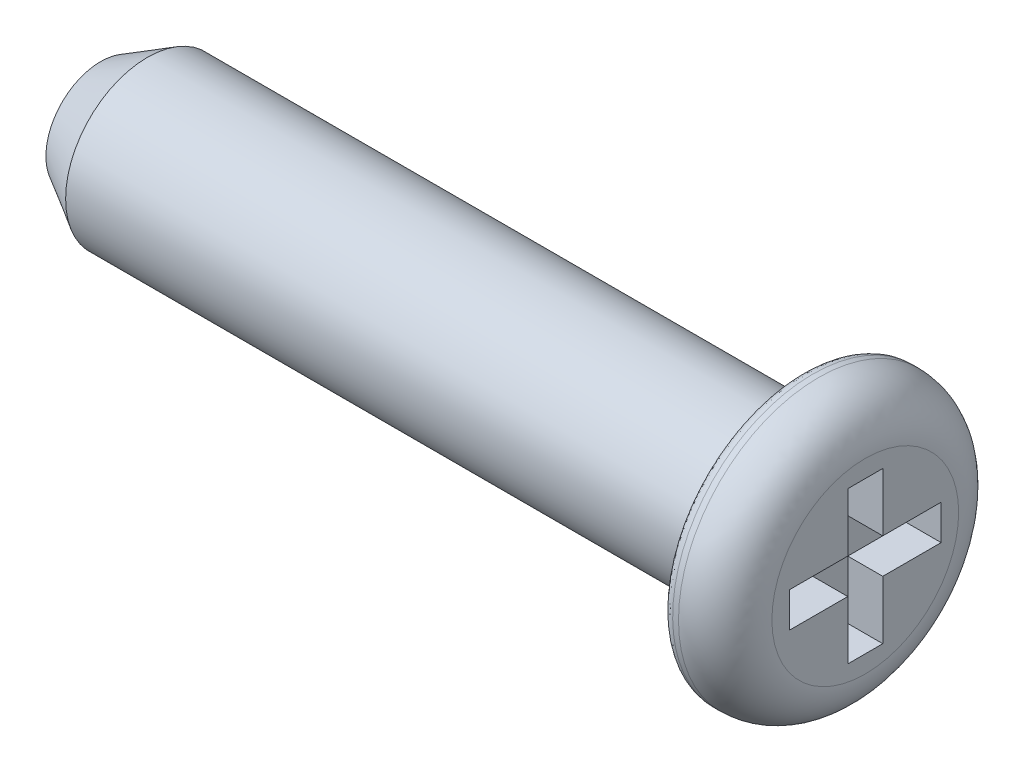
ISO-10303-21;
HEADER;
FILE_DESCRIPTION(('STEP AP214'),'2;1');
FILE_NAME('part.step','',(''),(''),'','','');
FILE_SCHEMA(('AUTOMOTIVE_DESIGN { 1 0 10303 214 1 1 1 1 }'));
ENDSEC;
DATA;
#1=APPLICATION_CONTEXT('core data for automotive mechanical design processes');
#2=APPLICATION_PROTOCOL_DEFINITION('international standard','automotive_design',2000,#1);
#3=PRODUCT_CONTEXT('',#1,'mechanical');
#4=PRODUCT('Part','Part','',(#3));
#5=PRODUCT_RELATED_PRODUCT_CATEGORY('part','',(#4));
#6=PRODUCT_DEFINITION_FORMATION('','',#4);
#7=PRODUCT_DEFINITION_CONTEXT('part definition',#1,'design');
#8=PRODUCT_DEFINITION('design','',#6,#7);
#9=PRODUCT_DEFINITION_SHAPE('','',#8);
#10=(LENGTH_UNIT() NAMED_UNIT(*) SI_UNIT(.MILLI.,.METRE.));
#11=(NAMED_UNIT(*) PLANE_ANGLE_UNIT() SI_UNIT($,.RADIAN.));
#12=(NAMED_UNIT(*) SI_UNIT($,.STERADIAN.) SOLID_ANGLE_UNIT());
#13=UNCERTAINTY_MEASURE_WITH_UNIT(LENGTH_MEASURE(1.E-05),#10,'distance_accuracy_value','');
#14=(GEOMETRIC_REPRESENTATION_CONTEXT(3) GLOBAL_UNCERTAINTY_ASSIGNED_CONTEXT((#13)) GLOBAL_UNIT_ASSIGNED_CONTEXT((#10,
#11,#12)) REPRESENTATION_CONTEXT('',''));
#15=CARTESIAN_POINT('',(0.,0.,0.));
#16=DIRECTION('',(0.,0.,1.));
#17=DIRECTION('',(1.,0.,0.));
#18=AXIS2_PLACEMENT_3D('',#15,#16,#17);
#19=CARTESIAN_POINT('',(6.75,29.024,9.876));
#20=DIRECTION('',(1.,0.,0.));
#21=DIRECTION('',(0.,0.,-1.));
#22=AXIS2_PLACEMENT_3D('',#19,#20,#21);
#23=PLANE('',#22);
#24=DIRECTION('',(0.,-1.,0.));
#25=VECTOR('',#24,1.);
#26=CARTESIAN_POINT('',(6.75,29.7,9.85));
#27=LINE('',#26,#25);
#28=CARTESIAN_POINT('',(6.75,29.85,9.85));
#29=VERTEX_POINT('',#28);
#30=CARTESIAN_POINT('',(6.75,29.55,9.85));
#31=VERTEX_POINT('',#30);
#32=EDGE_CURVE('E175',#29,#31,#27,.T.);
#33=ORIENTED_EDGE('',*,*,#32,.T.);
#34=DIRECTION('',(0.,0.,-1.));
#35=VECTOR('',#34,1.);
#36=CARTESIAN_POINT('',(6.75,29.55,9.6));
#37=LINE('',#36,#35);
#38=CARTESIAN_POINT('',(6.75,29.55,9.35));
#39=VERTEX_POINT('',#38);
#40=EDGE_CURVE('E368',#31,#39,#37,.T.);
#41=ORIENTED_EDGE('',*,*,#40,.T.);
#42=DIRECTION('',(0.,-1.,0.));
#43=VECTOR('',#42,1.);
#44=CARTESIAN_POINT('',(6.75,29.3,9.35));
#45=LINE('',#44,#43);
#46=CARTESIAN_POINT('',(6.75,29.05,9.35));
#47=VERTEX_POINT('',#46);
#48=EDGE_CURVE('E361',#39,#47,#45,.T.);
#49=ORIENTED_EDGE('',*,*,#48,.T.);
#50=DIRECTION('',(0.,0.,-1.));
#51=VECTOR('',#50,1.);
#52=CARTESIAN_POINT('',(6.75,29.05,9.2));
#53=LINE('',#52,#51);
#54=CARTESIAN_POINT('',(6.75,29.05,9.05));
#55=VERTEX_POINT('',#54);
#56=EDGE_CURVE('E354',#47,#55,#53,.T.);
#57=ORIENTED_EDGE('',*,*,#56,.T.);
#58=DIRECTION('',(0.,1.,0.));
#59=VECTOR('',#58,1.);
#60=CARTESIAN_POINT('',(6.75,29.3,9.05));
#61=LINE('',#60,#59);
#62=CARTESIAN_POINT('',(6.75,29.55,9.05));
#63=VERTEX_POINT('',#62);
#64=EDGE_CURVE('E347',#55,#63,#61,.T.);
#65=ORIENTED_EDGE('',*,*,#64,.T.);
#66=DIRECTION('',(0.,0.,-1.));
#67=VECTOR('',#66,1.);
#68=CARTESIAN_POINT('',(6.75,29.55,8.8));
#69=LINE('',#68,#67);
#70=CARTESIAN_POINT('',(6.75,29.55,8.55));
#71=VERTEX_POINT('',#70);
#72=EDGE_CURVE('E340',#63,#71,#69,.T.);
#73=ORIENTED_EDGE('',*,*,#72,.T.);
#74=DIRECTION('',(0.,1.,0.));
#75=VECTOR('',#74,1.);
#76=CARTESIAN_POINT('',(6.75,29.7,8.55));
#77=LINE('',#76,#75);
#78=CARTESIAN_POINT('',(6.75,29.85,8.55));
#79=VERTEX_POINT('',#78);
#80=EDGE_CURVE('E333',#71,#79,#77,.T.);
#81=ORIENTED_EDGE('',*,*,#80,.T.);
#82=DIRECTION('',(0.,0.,1.));
#83=VECTOR('',#82,1.);
#84=CARTESIAN_POINT('',(6.75,29.85,8.8));
#85=LINE('',#84,#83);
#86=CARTESIAN_POINT('',(6.75,29.85,9.05));
#87=VERTEX_POINT('',#86);
#88=EDGE_CURVE('E326',#79,#87,#85,.T.);
#89=ORIENTED_EDGE('',*,*,#88,.T.);
#90=DIRECTION('',(0.,1.,0.));
#91=VECTOR('',#90,1.);
#92=CARTESIAN_POINT('',(6.75,30.1,9.05));
#93=LINE('',#92,#91);
#94=CARTESIAN_POINT('',(6.75,30.35,9.05));
#95=VERTEX_POINT('',#94);
#96=EDGE_CURVE('E319',#87,#95,#93,.T.);
#97=ORIENTED_EDGE('',*,*,#96,.T.);
#98=DIRECTION('',(0.,0.,1.));
#99=VECTOR('',#98,1.);
#100=CARTESIAN_POINT('',(6.75,30.35,9.2));
#101=LINE('',#100,#99);
#102=CARTESIAN_POINT('',(6.75,30.35,9.35));
#103=VERTEX_POINT('',#102);
#104=EDGE_CURVE('E153',#95,#103,#101,.T.);
#105=ORIENTED_EDGE('',*,*,#104,.T.);
#106=DIRECTION('',(0.,-1.,0.));
#107=VECTOR('',#106,1.);
#108=CARTESIAN_POINT('',(6.75,30.1,9.35));
#109=LINE('',#108,#107);
#110=CARTESIAN_POINT('',(6.75,29.85,9.35));
#111=VERTEX_POINT('',#110);
#112=EDGE_CURVE('E150',#103,#111,#109,.T.);
#113=ORIENTED_EDGE('',*,*,#112,.T.);
#114=DIRECTION('',(0.,0.,1.));
#115=VECTOR('',#114,1.);
#116=CARTESIAN_POINT('',(6.75,29.85,9.6));
#117=LINE('',#116,#115);
#118=EDGE_CURVE('E146',#111,#29,#117,.T.);
#119=ORIENTED_EDGE('',*,*,#118,.T.);
#120=EDGE_LOOP('',(#33,#41,#49,#57,#65,#73,#81,#89,#97,#105,#113,#119));
#121=FACE_BOUND('',#120,.T.);
#122=ADVANCED_FACE('F16',(#121),#23,.T.);
#123=CARTESIAN_POINT('',(6.741146467985,30.36,9.35));
#124=DIRECTION('',(0.,0.,1.));
#125=DIRECTION('',(0.,-1.,0.));
#126=AXIS2_PLACEMENT_3D('',#123,#124,#125);
#127=PLANE('',#126);
#128=ORIENTED_EDGE('',*,*,#112,.F.);
#129=DIRECTION('',(1.,0.,0.));
#130=VECTOR('',#129,1.);
#131=CARTESIAN_POINT('',(6.9,30.35,9.35));
#132=LINE('',#131,#130);
#133=CARTESIAN_POINT('',(7.05,30.35,9.35));
#134=VERTEX_POINT('',#133);
#135=EDGE_CURVE('E305',#103,#134,#132,.T.);
#136=ORIENTED_EDGE('',*,*,#135,.T.);
#137=DIRECTION('',(0.,1.,0.));
#138=VECTOR('',#137,1.);
#139=CARTESIAN_POINT('',(7.05,29.7,9.35));
#140=LINE('',#139,#138);
#141=CARTESIAN_POINT('',(7.05,29.85,9.35));
#142=VERTEX_POINT('',#141);
#143=EDGE_CURVE('E162',#134,#142,#140,.F.);
#144=ORIENTED_EDGE('',*,*,#143,.T.);
#145=DIRECTION('',(-1.,0.,0.));
#146=VECTOR('',#145,1.);
#147=CARTESIAN_POINT('',(6.9,29.85,9.35));
#148=LINE('',#147,#146);
#149=EDGE_CURVE('E157',#142,#111,#148,.T.);
#150=ORIENTED_EDGE('',*,*,#149,.T.);
#151=EDGE_LOOP('',(#128,#136,#144,#150));
#152=FACE_BOUND('',#151,.T.);
#153=ADVANCED_FACE('F160',(#152),#127,.F.);
#154=CARTESIAN_POINT('',(6.741146467985,29.85,9.34));
#155=DIRECTION('',(0.,1.,0.));
#156=DIRECTION('',(0.,0.,1.));
#157=AXIS2_PLACEMENT_3D('',#154,#155,#156);
#158=PLANE('',#157);
#159=ORIENTED_EDGE('',*,*,#118,.F.);
#160=ORIENTED_EDGE('',*,*,#149,.F.);
#161=DIRECTION('',(0.,0.,-1.));
#162=VECTOR('',#161,1.);
#163=CARTESIAN_POINT('',(7.05,29.85,9.2));
#164=LINE('',#163,#162);
#165=CARTESIAN_POINT('',(7.05,29.85,9.85));
#166=VERTEX_POINT('',#165);
#167=EDGE_CURVE('E430',#142,#166,#164,.F.);
#168=ORIENTED_EDGE('',*,*,#167,.T.);
#169=DIRECTION('',(-1.,0.,0.));
#170=VECTOR('',#169,1.);
#171=CARTESIAN_POINT('',(6.9,29.85,9.85));
#172=LINE('',#171,#170);
#173=EDGE_CURVE('E169',#166,#29,#172,.T.);
#174=ORIENTED_EDGE('',*,*,#173,.T.);
#175=EDGE_LOOP('',(#159,#160,#168,#174));
#176=FACE_BOUND('',#175,.T.);
#177=ADVANCED_FACE('F167',(#176),#158,.F.);
#178=CARTESIAN_POINT('',(6.741146467985,29.85885353202,9.85));
#179=DIRECTION('',(0.,0.,1.));
#180=DIRECTION('',(0.,-1.,0.));
#181=AXIS2_PLACEMENT_3D('',#178,#179,#180);
#182=PLANE('',#181);
#183=ORIENTED_EDGE('',*,*,#32,.F.);
#184=ORIENTED_EDGE('',*,*,#173,.F.);
#185=DIRECTION('',(0.,1.,0.));
#186=VECTOR('',#185,1.);
#187=CARTESIAN_POINT('',(7.05,29.7,9.85));
#188=LINE('',#187,#186);
#189=CARTESIAN_POINT('',(7.05,29.55,9.85));
#190=VERTEX_POINT('',#189);
#191=EDGE_CURVE('E380',#166,#190,#188,.F.);
#192=ORIENTED_EDGE('',*,*,#191,.T.);
#193=DIRECTION('',(-1.,0.,0.));
#194=VECTOR('',#193,1.);
#195=CARTESIAN_POINT('',(6.9,29.55,9.85));
#196=LINE('',#195,#194);
#197=EDGE_CURVE('E371',#190,#31,#196,.T.);
#198=ORIENTED_EDGE('',*,*,#197,.T.);
#199=EDGE_LOOP('',(#183,#184,#192,#198));
#200=FACE_BOUND('',#199,.T.);
#201=ADVANCED_FACE('F378',(#200),#182,.F.);
#202=CARTESIAN_POINT('',(6.741146467985,29.55,9.86));
#203=DIRECTION('',(0.,-1.,0.));
#204=DIRECTION('',(0.,0.,-1.));
#205=AXIS2_PLACEMENT_3D('',#202,#203,#204);
#206=PLANE('',#205);
#207=ORIENTED_EDGE('',*,*,#40,.F.);
#208=ORIENTED_EDGE('',*,*,#197,.F.);
#209=DIRECTION('',(0.,0.,1.));
#210=VECTOR('',#209,1.);
#211=CARTESIAN_POINT('',(7.05,29.55,9.2));
#212=LINE('',#211,#210);
#213=CARTESIAN_POINT('',(7.05,29.55,9.35));
#214=VERTEX_POINT('',#213);
#215=EDGE_CURVE('E386',#190,#214,#212,.F.);
#216=ORIENTED_EDGE('',*,*,#215,.T.);
#217=DIRECTION('',(-1.,0.,0.));
#218=VECTOR('',#217,1.);
#219=CARTESIAN_POINT('',(6.9,29.55,9.35));
#220=LINE('',#219,#218);
#221=EDGE_CURVE('E364',#214,#39,#220,.T.);
#222=ORIENTED_EDGE('',*,*,#221,.T.);
#223=EDGE_LOOP('',(#207,#208,#216,#222));
#224=FACE_BOUND('',#223,.T.);
#225=ADVANCED_FACE('F383',(#224),#206,.F.);
#226=CARTESIAN_POINT('',(6.741146467985,29.56,9.35));
#227=DIRECTION('',(0.,0.,1.));
#228=DIRECTION('',(0.,-1.,0.));
#229=AXIS2_PLACEMENT_3D('',#226,#227,#228);
#230=PLANE('',#229);
#231=ORIENTED_EDGE('',*,*,#48,.F.);
#232=ORIENTED_EDGE('',*,*,#221,.F.);
#233=DIRECTION('',(0.,1.,0.));
#234=VECTOR('',#233,1.);
#235=CARTESIAN_POINT('',(7.05,29.7,9.35));
#236=LINE('',#235,#234);
#237=CARTESIAN_POINT('',(7.05,29.05,9.35));
#238=VERTEX_POINT('',#237);
#239=EDGE_CURVE('E440',#214,#238,#236,.F.);
#240=ORIENTED_EDGE('',*,*,#239,.T.);
#241=DIRECTION('',(-1.,0.,0.));
#242=VECTOR('',#241,1.);
#243=CARTESIAN_POINT('',(6.9,29.05,9.35));
#244=LINE('',#243,#242);
#245=EDGE_CURVE('E357',#238,#47,#244,.T.);
#246=ORIENTED_EDGE('',*,*,#245,.T.);
#247=EDGE_LOOP('',(#231,#232,#240,#246));
#248=FACE_BOUND('',#247,.T.);
#249=ADVANCED_FACE('F389',(#248),#230,.F.);
#250=CARTESIAN_POINT('',(6.741146467985,29.05,9.358853532015));
#251=DIRECTION('',(0.,-1.,0.));
#252=DIRECTION('',(0.,0.,-1.));
#253=AXIS2_PLACEMENT_3D('',#250,#251,#252);
#254=PLANE('',#253);
#255=ORIENTED_EDGE('',*,*,#56,.F.);
#256=ORIENTED_EDGE('',*,*,#245,.F.);
#257=DIRECTION('',(0.,0.,1.));
#258=VECTOR('',#257,1.);
#259=CARTESIAN_POINT('',(7.05,29.05,9.2));
#260=LINE('',#259,#258);
#261=CARTESIAN_POINT('',(7.05,29.05,9.05));
#262=VERTEX_POINT('',#261);
#263=EDGE_CURVE('E397',#238,#262,#260,.F.);
#264=ORIENTED_EDGE('',*,*,#263,.T.);
#265=DIRECTION('',(-1.,0.,0.));
#266=VECTOR('',#265,1.);
#267=CARTESIAN_POINT('',(6.9,29.05,9.05));
#268=LINE('',#267,#266);
#269=EDGE_CURVE('E350',#262,#55,#268,.T.);
#270=ORIENTED_EDGE('',*,*,#269,.T.);
#271=EDGE_LOOP('',(#255,#256,#264,#270));
#272=FACE_BOUND('',#271,.T.);
#273=ADVANCED_FACE('F395',(#272),#254,.F.);
#274=CARTESIAN_POINT('',(6.741146467985,29.04,9.05));
#275=DIRECTION('',(0.,0.,-1.));
#276=DIRECTION('',(0.,1.,0.));
#277=AXIS2_PLACEMENT_3D('',#274,#275,#276);
#278=PLANE('',#277);
#279=ORIENTED_EDGE('',*,*,#64,.F.);
#280=ORIENTED_EDGE('',*,*,#269,.F.);
#281=DIRECTION('',(0.,-1.,0.));
#282=VECTOR('',#281,1.);
#283=CARTESIAN_POINT('',(7.05,29.7,9.05));
#284=LINE('',#283,#282);
#285=CARTESIAN_POINT('',(7.05,29.55,9.05));
#286=VERTEX_POINT('',#285);
#287=EDGE_CURVE('E403',#262,#286,#284,.F.);
#288=ORIENTED_EDGE('',*,*,#287,.T.);
#289=DIRECTION('',(-1.,0.,0.));
#290=VECTOR('',#289,1.);
#291=CARTESIAN_POINT('',(6.9,29.55,9.05));
#292=LINE('',#291,#290);
#293=EDGE_CURVE('E343',#286,#63,#292,.T.);
#294=ORIENTED_EDGE('',*,*,#293,.T.);
#295=EDGE_LOOP('',(#279,#280,#288,#294));
#296=FACE_BOUND('',#295,.T.);
#297=ADVANCED_FACE('F400',(#296),#278,.F.);
#298=CARTESIAN_POINT('',(6.741146467985,29.55,9.06));
#299=DIRECTION('',(0.,-1.,0.));
#300=DIRECTION('',(0.,0.,-1.));
#301=AXIS2_PLACEMENT_3D('',#298,#299,#300);
#302=PLANE('',#301);
#303=ORIENTED_EDGE('',*,*,#72,.F.);
#304=ORIENTED_EDGE('',*,*,#293,.F.);
#305=DIRECTION('',(0.,0.,1.));
#306=VECTOR('',#305,1.);
#307=CARTESIAN_POINT('',(7.05,29.55,9.2));
#308=LINE('',#307,#306);
#309=CARTESIAN_POINT('',(7.05,29.55,8.55));
#310=VERTEX_POINT('',#309);
#311=EDGE_CURVE('E446',#286,#310,#308,.F.);
#312=ORIENTED_EDGE('',*,*,#311,.T.);
#313=DIRECTION('',(-1.,0.,0.));
#314=VECTOR('',#313,1.);
#315=CARTESIAN_POINT('',(6.9,29.55,8.55));
#316=LINE('',#315,#314);
#317=EDGE_CURVE('E336',#310,#71,#316,.T.);
#318=ORIENTED_EDGE('',*,*,#317,.T.);
#319=EDGE_LOOP('',(#303,#304,#312,#318));
#320=FACE_BOUND('',#319,.T.);
#321=ADVANCED_FACE('F406',(#320),#302,.F.);
#322=CARTESIAN_POINT('',(6.741146467985,29.54114646798,8.55));
#323=DIRECTION('',(0.,0.,-1.));
#324=DIRECTION('',(0.,1.,0.));
#325=AXIS2_PLACEMENT_3D('',#322,#323,#324);
#326=PLANE('',#325);
#327=ORIENTED_EDGE('',*,*,#80,.F.);
#328=ORIENTED_EDGE('',*,*,#317,.F.);
#329=DIRECTION('',(0.,-1.,0.));
#330=VECTOR('',#329,1.);
#331=CARTESIAN_POINT('',(7.05,29.7,8.55));
#332=LINE('',#331,#330);
#333=CARTESIAN_POINT('',(7.05,29.85,8.55));
#334=VERTEX_POINT('',#333);
#335=EDGE_CURVE('E414',#310,#334,#332,.F.);
#336=ORIENTED_EDGE('',*,*,#335,.T.);
#337=DIRECTION('',(-1.,0.,0.));
#338=VECTOR('',#337,1.);
#339=CARTESIAN_POINT('',(6.9,29.85,8.55));
#340=LINE('',#339,#338);
#341=EDGE_CURVE('E329',#334,#79,#340,.T.);
#342=ORIENTED_EDGE('',*,*,#341,.T.);
#343=EDGE_LOOP('',(#327,#328,#336,#342));
#344=FACE_BOUND('',#343,.T.);
#345=ADVANCED_FACE('F412',(#344),#326,.F.);
#346=CARTESIAN_POINT('',(6.741146467985,29.85,8.54));
#347=DIRECTION('',(0.,1.,0.));
#348=DIRECTION('',(0.,0.,1.));
#349=AXIS2_PLACEMENT_3D('',#346,#347,#348);
#350=PLANE('',#349);
#351=ORIENTED_EDGE('',*,*,#88,.F.);
#352=ORIENTED_EDGE('',*,*,#341,.F.);
#353=DIRECTION('',(0.,0.,-1.));
#354=VECTOR('',#353,1.);
#355=CARTESIAN_POINT('',(7.05,29.85,9.2));
#356=LINE('',#355,#354);
#357=CARTESIAN_POINT('',(7.05,29.85,9.05));
#358=VERTEX_POINT('',#357);
#359=EDGE_CURVE('E420',#334,#358,#356,.F.);
#360=ORIENTED_EDGE('',*,*,#359,.T.);
#361=DIRECTION('',(-1.,0.,0.));
#362=VECTOR('',#361,1.);
#363=CARTESIAN_POINT('',(6.9,29.85,9.05));
#364=LINE('',#363,#362);
#365=EDGE_CURVE('E322',#358,#87,#364,.T.);
#366=ORIENTED_EDGE('',*,*,#365,.T.);
#367=EDGE_LOOP('',(#351,#352,#360,#366));
#368=FACE_BOUND('',#367,.T.);
#369=ADVANCED_FACE('F417',(#368),#350,.F.);
#370=CARTESIAN_POINT('',(6.741146467985,29.84,9.05));
#371=DIRECTION('',(0.,0.,-1.));
#372=DIRECTION('',(0.,1.,0.));
#373=AXIS2_PLACEMENT_3D('',#370,#371,#372);
#374=PLANE('',#373);
#375=ORIENTED_EDGE('',*,*,#96,.F.);
#376=ORIENTED_EDGE('',*,*,#365,.F.);
#377=DIRECTION('',(0.,-1.,0.));
#378=VECTOR('',#377,1.);
#379=CARTESIAN_POINT('',(7.05,29.7,9.05));
#380=LINE('',#379,#378);
#381=CARTESIAN_POINT('',(7.05,30.35,9.05));
#382=VERTEX_POINT('',#381);
#383=EDGE_CURVE('E425',#358,#382,#380,.F.);
#384=ORIENTED_EDGE('',*,*,#383,.T.);
#385=DIRECTION('',(-1.,0.,0.));
#386=VECTOR('',#385,1.);
#387=CARTESIAN_POINT('',(6.9,30.35,9.05));
#388=LINE('',#387,#386);
#389=EDGE_CURVE('E315',#382,#95,#388,.T.);
#390=ORIENTED_EDGE('',*,*,#389,.T.);
#391=EDGE_LOOP('',(#375,#376,#384,#390));
#392=FACE_BOUND('',#391,.T.);
#393=ADVANCED_FACE('F423',(#392),#374,.F.);
#394=CARTESIAN_POINT('',(6.741146467985,30.35,9.041146467985));
#395=DIRECTION('',(0.,1.,0.));
#396=DIRECTION('',(0.,0.,1.));
#397=AXIS2_PLACEMENT_3D('',#394,#395,#396);
#398=PLANE('',#397);
#399=ORIENTED_EDGE('',*,*,#104,.F.);
#400=ORIENTED_EDGE('',*,*,#389,.F.);
#401=DIRECTION('',(0.,0.,-1.));
#402=VECTOR('',#401,1.);
#403=CARTESIAN_POINT('',(7.05,30.35,9.2));
#404=LINE('',#403,#402);
#405=EDGE_CURVE('E288',#382,#134,#404,.F.);
#406=ORIENTED_EDGE('',*,*,#405,.T.);
#407=ORIENTED_EDGE('',*,*,#135,.F.);
#408=EDGE_LOOP('',(#399,#400,#406,#407));
#409=FACE_BOUND('',#408,.T.);
#410=ADVANCED_FACE('F199',(#409),#398,.F.);
#411=CARTESIAN_POINT('',(7.05,28.86716642063,10.032));
#412=DIRECTION('',(1.,0.,0.));
#413=DIRECTION('',(0.,0.,-1.));
#414=AXIS2_PLACEMENT_3D('',#411,#412,#413);
#415=PLANE('',#414);
#416=ORIENTED_EDGE('',*,*,#383,.F.);
#417=ORIENTED_EDGE('',*,*,#359,.F.);
#418=ORIENTED_EDGE('',*,*,#335,.F.);
#419=ORIENTED_EDGE('',*,*,#311,.F.);
#420=ORIENTED_EDGE('',*,*,#287,.F.);
#421=ORIENTED_EDGE('',*,*,#263,.F.);
#422=ORIENTED_EDGE('',*,*,#239,.F.);
#423=ORIENTED_EDGE('',*,*,#215,.F.);
#424=ORIENTED_EDGE('',*,*,#191,.F.);
#425=ORIENTED_EDGE('',*,*,#167,.F.);
#426=ORIENTED_EDGE('',*,*,#143,.F.);
#427=ORIENTED_EDGE('',*,*,#405,.F.);
#428=EDGE_LOOP('',(#416,#417,#418,#419,#420,#421,#422,#423,#424,#425,#426,#427));
#429=FACE_BOUND('',#428,.T.);
#430=CARTESIAN_POINT('',(7.05000000000001,29.7,9.2));
#431=DIRECTION('',(-1.,0.,0.));
#432=DIRECTION('',(0.,-7.93635999183127E-13,-1.));
#433=AXIS2_PLACEMENT_3D('',#430,#431,#432);
#434=CIRCLE('',#433,0.799999991004705);
#435=CARTESIAN_POINT('',(7.05000000000001,29.7000000000001,9.9999999919042));
#436=VERTEX_POINT('',#435);
#437=CARTESIAN_POINT('',(7.05000000000001,29.6999999999996,8.4000000080958));
#438=VERTEX_POINT('',#437);
#439=EDGE_CURVE('E182',#436,#438,#434,.F.);
#440=ORIENTED_EDGE('',*,*,#439,.T.);
#441=CARTESIAN_POINT('',(7.05000000000001,29.7,9.2));
#442=DIRECTION('',(-1.,0.,0.));
#443=DIRECTION('',(0.,0.,1.));
#444=AXIS2_PLACEMENT_3D('',#441,#442,#443);
#445=CIRCLE('',#444,0.799999991004705);
#446=EDGE_CURVE('E283',#438,#436,#445,.F.);
#447=ORIENTED_EDGE('',*,*,#446,.T.);
#448=EDGE_LOOP('',(#440,#447));
#449=FACE_BOUND('',#448,.T.);
#450=ADVANCED_FACE('F189',(#429,#449),#415,.T.);
#451=CARTESIAN_POINT('',(6.63743568920142,29.688657572761,8.00025099053532));
#452=CARTESIAN_POINT('',(6.88347384142366,29.6885844770859,7.99251927120719));
#453=CARTESIAN_POINT('',(7.05753489804068,29.6902299782706,8.1665727057349));
#454=CARTESIAN_POINT('',(7.04980261265878,29.6925559189753,8.41259985655019));
#455=(BOUNDED_CURVE() B_SPLINE_CURVE(3,(#451,#452,#453,#454),.UNSPECIFIED.,.F.,
.F.) B_SPLINE_CURVE_WITH_KNOTS((4,4),(0.,1.),
.UNSPECIFIED.) CURVE() GEOMETRIC_REPRESENTATION_ITEM() RATIONAL_B_SPLINE_CURVE((1.,
0.789697844101268,0.789697844101268,1.)) REPRESENTATION_ITEM(''));
#456=CARTESIAN_POINT('',(6.65,29.7,9.2));
#457=DIRECTION('',(1.,0.,0.));
#458=AXIS1_PLACEMENT('',#456,#457);
#459=SURFACE_OF_REVOLUTION('',#455,#458);
#460=CARTESIAN_POINT('',(6.65,29.7,9.2));
#461=DIRECTION('',(1.,0.,0.));
#462=DIRECTION('',(0.,0.,-1.));
#463=AXIS2_PLACEMENT_3D('',#460,#461,#462);
#464=CIRCLE('',#463,1.2);
#465=CARTESIAN_POINT('',(6.65,29.7,8.));
#466=VERTEX_POINT('',#465);
#467=EDGE_CURVE('E279',#466,#466,#464,.T.);
#468=ORIENTED_EDGE('',*,*,#467,.T.);
#469=EDGE_LOOP('',(#468));
#470=FACE_BOUND('',#469,.T.);
#471=ORIENTED_EDGE('',*,*,#439,.F.);
#472=ORIENTED_EDGE('',*,*,#446,.F.);
#473=EDGE_LOOP('',(#471,#472));
#474=FACE_BOUND('',#473,.T.);
#475=ADVANCED_FACE('F198',(#470,#474),#459,.T.);
#476=CARTESIAN_POINT('',(6.6,29.7,9.2));
#477=DIRECTION('',(1.,0.,0.));
#478=DIRECTION('',(0.,1.,0.));
#479=AXIS2_PLACEMENT_3D('',#476,#477,#478);
#480=CYLINDRICAL_SURFACE('',#479,1.2);
#481=CARTESIAN_POINT('',(6.6,29.7,9.2));
#482=DIRECTION('',(1.,0.,0.));
#483=DIRECTION('',(0.,-0.013429129399921,0.999909825176031));
#484=AXIS2_PLACEMENT_3D('',#481,#482,#483);
#485=CIRCLE('',#484,1.19999999999636);
#486=CARTESIAN_POINT('',(6.6,29.6838850447201,10.3998917902076));
#487=VERTEX_POINT('',#486);
#488=EDGE_CURVE('E275',#487,#487,#485,.T.);
#489=ORIENTED_EDGE('',*,*,#488,.T.);
#490=EDGE_LOOP('',(#489));
#491=FACE_BOUND('',#490,.T.);
#492=ORIENTED_EDGE('',*,*,#467,.F.);
#493=EDGE_LOOP('',(#492));
#494=FACE_BOUND('',#493,.T.);
#495=ADVANCED_FACE('F251',(#491,#494),#480,.T.);
#496=CARTESIAN_POINT('',(6.50039170687413,29.68534670332,10.2910592105481));
#497=CARTESIAN_POINT('',(6.49445300850722,29.6844483136756,10.3579517547749));
#498=CARTESIAN_POINT('',(6.54194336804711,29.6838105567751,10.4054380341856));
#499=CARTESIAN_POINT('',(6.60884197014127,29.6838903044966,10.3995001563226));
#500=(BOUNDED_CURVE() B_SPLINE_CURVE(3,(#496,#497,#498,#499),.UNSPECIFIED.,.F.,
.F.) B_SPLINE_CURVE_WITH_KNOTS((4,4),(0.,1.),
.UNSPECIFIED.) CURVE() GEOMETRIC_REPRESENTATION_ITEM() RATIONAL_B_SPLINE_CURVE((1.,
0.761208971798791,0.761208971798791,1.)) REPRESENTATION_ITEM(''));
#501=CARTESIAN_POINT('',(6.6,29.7,9.2));
#502=DIRECTION('',(1.,0.,0.));
#503=AXIS1_PLACEMENT('',#501,#502);
#504=SURFACE_OF_REVOLUTION('',#500,#503);
#505=ORIENTED_EDGE('',*,*,#488,.F.);
#506=EDGE_LOOP('',(#505));
#507=FACE_BOUND('',#506,.T.);
#508=CARTESIAN_POINT('',(6.5,29.7,9.2));
#509=DIRECTION('',(1.,0.,0.));
#510=DIRECTION('',(0.,0.,1.));
#511=AXIS2_PLACEMENT_3D('',#508,#509,#510);
#512=CIRCLE('',#511,1.09999998207468);
#513=CARTESIAN_POINT('',(6.5,29.6999999999999,10.2999999749036));
#514=VERTEX_POINT('',#513);
#515=CARTESIAN_POINT('',(6.5,29.7,8.10000002509639));
#516=VERTEX_POINT('',#515);
#517=EDGE_CURVE('E41',#514,#516,#512,.T.);
#518=ORIENTED_EDGE('',*,*,#517,.T.);
#519=CARTESIAN_POINT('',(6.5,29.7,9.2));
#520=DIRECTION('',(1.,0.,0.));
#521=DIRECTION('',(0.,0.,-1.));
#522=AXIS2_PLACEMENT_3D('',#519,#520,#521);
#523=CIRCLE('',#522,1.09999998207268);
#524=EDGE_CURVE('E224',#516,#514,#523,.T.);
#525=ORIENTED_EDGE('',*,*,#524,.T.);
#526=EDGE_LOOP('',(#518,#525));
#527=FACE_BOUND('',#526,.T.);
#528=ADVANCED_FACE('F240',(#507,#527),#504,.T.);
#529=CARTESIAN_POINT('',(6.5,28.55599999748,10.344));
#530=DIRECTION('',(1.,0.,0.));
#531=DIRECTION('',(0.,0.,-1.));
#532=AXIS2_PLACEMENT_3D('',#529,#530,#531);
#533=PLANE('',#532);
#534=CARTESIAN_POINT('',(6.5,29.7,9.2));
#535=DIRECTION('',(-1.,0.,0.));
#536=DIRECTION('',(0.,0.,1.));
#537=AXIS2_PLACEMENT_3D('',#534,#535,#536);
#538=CIRCLE('',#537,0.699999999999996);
#539=CARTESIAN_POINT('',(6.5,29.7,9.9));
#540=VERTEX_POINT('',#539);
#541=EDGE_CURVE('E233',#540,#540,#538,.F.);
#542=ORIENTED_EDGE('',*,*,#541,.T.);
#543=EDGE_LOOP('',(#542));
#544=FACE_BOUND('',#543,.T.);
#545=ORIENTED_EDGE('',*,*,#517,.F.);
#546=ORIENTED_EDGE('',*,*,#524,.F.);
#547=EDGE_LOOP('',(#545,#546));
#548=FACE_BOUND('',#547,.T.);
#549=ADVANCED_FACE('F202',(#544,#548),#533,.F.);
#550=CARTESIAN_POINT('',(6.5,29.7,9.2));
#551=DIRECTION('',(-1.,0.,0.));
#552=DIRECTION('',(0.,0.,1.));
#553=AXIS2_PLACEMENT_3D('',#550,#551,#552);
#554=CYLINDRICAL_SURFACE('',#553,0.699999999999996);
#555=CARTESIAN_POINT('',(0.900000000001497,29.7,9.2));
#556=DIRECTION('',(-1.,0.,0.));
#557=DIRECTION('',(0.,-1.,0.));
#558=AXIS2_PLACEMENT_3D('',#555,#556,#557);
#559=CIRCLE('',#558,0.699999999997408);
#560=CARTESIAN_POINT('',(0.900000000001497,29.0000000000026,9.2));
#561=VERTEX_POINT('',#560);
#562=EDGE_CURVE('E29',#561,#561,#559,.F.);
#563=ORIENTED_EDGE('',*,*,#562,.T.);
#564=EDGE_LOOP('',(#563));
#565=FACE_BOUND('',#564,.T.);
#566=ORIENTED_EDGE('',*,*,#541,.F.);
#567=EDGE_LOOP('',(#566));
#568=FACE_BOUND('',#567,.T.);
#569=ADVANCED_FACE('F253',(#565,#568),#554,.T.);
#570=CARTESIAN_POINT('',(0.900000000001497,29.7,9.2));
#571=DIRECTION('',(1.,0.,0.));
#572=DIRECTION('',(0.,0.,-1.));
#573=AXIS2_PLACEMENT_3D('',#570,#571,#572);
#574=CONICAL_SURFACE('',#573,0.699999999997408,0.523598775593107);
#575=ORIENTED_EDGE('',*,*,#562,.F.);
#576=EDGE_LOOP('',(#575));
#577=FACE_BOUND('',#576,.T.);
#578=CARTESIAN_POINT('',(0.500000000000277,29.7,9.2));
#579=DIRECTION('',(1.,0.,0.));
#580=DIRECTION('',(0.,0.,-1.));
#581=AXIS2_PLACEMENT_3D('',#578,#579,#580);
#582=CIRCLE('',#581,0.469059892323622);
#583=CARTESIAN_POINT('',(0.500000000000277,29.7,8.73094010767638));
#584=VERTEX_POINT('',#583);
#585=EDGE_CURVE('E11',#584,#584,#582,.T.);
#586=ORIENTED_EDGE('',*,*,#585,.T.);
#587=EDGE_LOOP('',(#586));
#588=FACE_BOUND('',#587,.T.);
#589=ADVANCED_FACE('F466',(#577,#588),#574,.T.);
#590=CARTESIAN_POINT('',(0.5,30.18782228802,8.712177711983));
#591=DIRECTION('',(-1.,0.,0.));
#592=DIRECTION('',(0.,-1.,0.));
#593=AXIS2_PLACEMENT_3D('',#590,#591,#592);
#594=PLANE('',#593);
#595=ORIENTED_EDGE('',*,*,#585,.F.);
#596=EDGE_LOOP('',(#595));
#597=FACE_BOUND('',#596,.T.);
#598=ADVANCED_FACE('F18',(#597),#594,.T.);
#599=CLOSED_SHELL('',(#122,#153,#177,#201,#225,#249,#273,#297,#321,#345,#369,#393,#410,#450,
#475,#495,#528,#549,#569,#589,#598));
#600=MANIFOLD_SOLID_BREP('B1',#599);
#601=ADVANCED_BREP_SHAPE_REPRESENTATION('',(#18,#600),#14);
#602=SHAPE_DEFINITION_REPRESENTATION(#9,#601);
ENDSEC;
END-ISO-10303-21;
